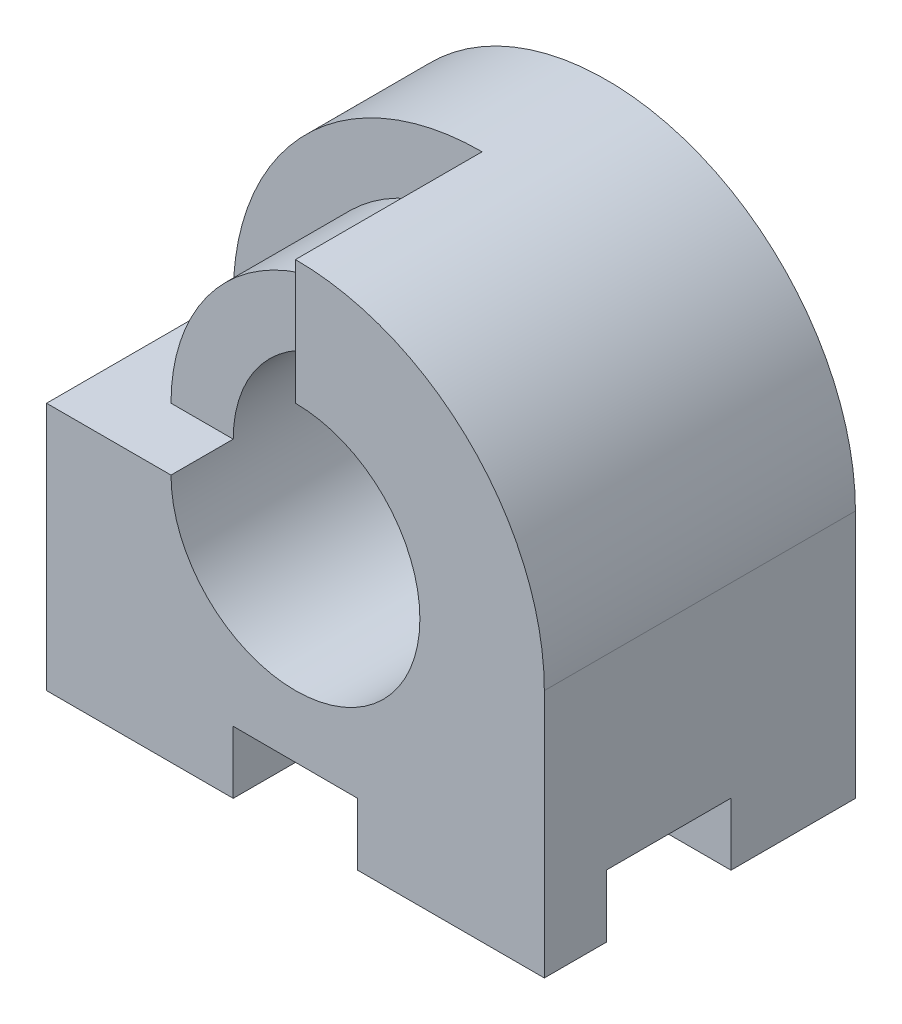
ISO-10303-21;
HEADER;
FILE_DESCRIPTION(('STEP AP214'),'2;1');
FILE_NAME('part.step','',(''),(''),'','','');
FILE_SCHEMA(('AUTOMOTIVE_DESIGN { 1 0 10303 214 1 1 1 1 }'));
ENDSEC;
DATA;
#1=APPLICATION_CONTEXT('core data for automotive mechanical design processes');
#2=APPLICATION_PROTOCOL_DEFINITION('international standard','automotive_design',2000,#1);
#3=PRODUCT_CONTEXT('',#1,'mechanical');
#4=PRODUCT('Part','Part','',(#3));
#5=PRODUCT_RELATED_PRODUCT_CATEGORY('part','',(#4));
#6=PRODUCT_DEFINITION_FORMATION('','',#4);
#7=PRODUCT_DEFINITION_CONTEXT('part definition',#1,'design');
#8=PRODUCT_DEFINITION('design','',#6,#7);
#9=PRODUCT_DEFINITION_SHAPE('','',#8);
#10=(LENGTH_UNIT() NAMED_UNIT(*) SI_UNIT(.MILLI.,.METRE.));
#11=(NAMED_UNIT(*) PLANE_ANGLE_UNIT() SI_UNIT($,.RADIAN.));
#12=(NAMED_UNIT(*) SI_UNIT($,.STERADIAN.) SOLID_ANGLE_UNIT());
#13=UNCERTAINTY_MEASURE_WITH_UNIT(LENGTH_MEASURE(1.E-05),#10,'distance_accuracy_value','');
#14=(GEOMETRIC_REPRESENTATION_CONTEXT(3) GLOBAL_UNCERTAINTY_ASSIGNED_CONTEXT((#13)) GLOBAL_UNIT_ASSIGNED_CONTEXT((#10,
#11,#12)) REPRESENTATION_CONTEXT('',''));
#15=CARTESIAN_POINT('',(0.,0.,0.));
#16=DIRECTION('',(0.,0.,1.));
#17=DIRECTION('',(1.,0.,0.));
#18=AXIS2_PLACEMENT_3D('',#15,#16,#17);
#19=CARTESIAN_POINT('',(4.,4.,2.));
#20=DIRECTION('',(0.,0.,-1.));
#21=DIRECTION('',(-1.,0.,0.));
#22=AXIS2_PLACEMENT_3D('',#19,#20,#21);
#23=PLANE('',#22);
#24=DIRECTION('',(1.,0.,0.));
#25=VECTOR('',#24,1.);
#26=CARTESIAN_POINT('',(0.,1.00354400233384,2.));
#27=LINE('',#26,#25);
#28=CARTESIAN_POINT('',(0.,1.00354400233384,2.));
#29=VERTEX_POINT('',#28);
#30=CARTESIAN_POINT('',(8.,1.00354400233384,2.));
#31=VERTEX_POINT('',#30);
#32=EDGE_CURVE('E240',#29,#31,#27,.T.);
#33=ORIENTED_EDGE('',*,*,#32,.F.);
#34=DIRECTION('',(0.,-1.,0.));
#35=VECTOR('',#34,1.);
#36=CARTESIAN_POINT('',(0.,4.,2.));
#37=LINE('',#36,#35);
#38=CARTESIAN_POINT('',(0.,0.,2.));
#39=VERTEX_POINT('',#38);
#40=EDGE_CURVE('E402',#29,#39,#37,.T.);
#41=ORIENTED_EDGE('',*,*,#40,.T.);
#42=DIRECTION('',(1.,0.,0.));
#43=VECTOR('',#42,1.);
#44=CARTESIAN_POINT('',(0.,0.,2.));
#45=LINE('',#44,#43);
#46=CARTESIAN_POINT('',(3.,0.,2.));
#47=VERTEX_POINT('',#46);
#48=EDGE_CURVE('E422',#39,#47,#45,.T.);
#49=ORIENTED_EDGE('',*,*,#48,.T.);
#50=DIRECTION('',(0.,1.,0.));
#51=VECTOR('',#50,1.);
#52=CARTESIAN_POINT('',(3.,0.,2.));
#53=LINE('',#52,#51);
#54=CARTESIAN_POINT('',(3.,1.,2.));
#55=VERTEX_POINT('',#54);
#56=EDGE_CURVE('E426',#47,#55,#53,.T.);
#57=ORIENTED_EDGE('',*,*,#56,.T.);
#58=DIRECTION('',(1.,0.,0.));
#59=VECTOR('',#58,1.);
#60=CARTESIAN_POINT('',(3.,1.,2.));
#61=LINE('',#60,#59);
#62=CARTESIAN_POINT('',(5.,1.,2.));
#63=VERTEX_POINT('',#62);
#64=EDGE_CURVE('E428',#55,#63,#61,.T.);
#65=ORIENTED_EDGE('',*,*,#64,.T.);
#66=DIRECTION('',(0.,-1.,0.));
#67=VECTOR('',#66,1.);
#68=CARTESIAN_POINT('',(5.,1.,2.));
#69=LINE('',#68,#67);
#70=CARTESIAN_POINT('',(5.,0.,2.));
#71=VERTEX_POINT('',#70);
#72=EDGE_CURVE('E430',#63,#71,#69,.T.);
#73=ORIENTED_EDGE('',*,*,#72,.T.);
#74=DIRECTION('',(1.,0.,0.));
#75=VECTOR('',#74,1.);
#76=CARTESIAN_POINT('',(5.,0.,2.));
#77=LINE('',#76,#75);
#78=CARTESIAN_POINT('',(8.,0.,2.));
#79=VERTEX_POINT('',#78);
#80=EDGE_CURVE('E375',#71,#79,#77,.T.);
#81=ORIENTED_EDGE('',*,*,#80,.T.);
#82=DIRECTION('',(0.,1.,0.));
#83=VECTOR('',#82,1.);
#84=CARTESIAN_POINT('',(8.,0.,2.));
#85=LINE('',#84,#83);
#86=EDGE_CURVE('E370',#79,#31,#85,.T.);
#87=ORIENTED_EDGE('',*,*,#86,.T.);
#88=EDGE_LOOP('',(#33,#41,#49,#57,#65,#73,#81,#87));
#89=FACE_BOUND('',#88,.T.);
#90=ADVANCED_FACE('F35',(#89),#23,.F.);
#91=CARTESIAN_POINT('',(4.,4.,2.));
#92=DIRECTION('',(0.,0.,1.));
#93=DIRECTION('',(1.,0.,0.));
#94=AXIS2_PLACEMENT_3D('',#91,#92,#93);
#95=CIRCLE('',#94,3.);
#96=CARTESIAN_POINT('',(1.,4.,2.));
#97=VERTEX_POINT('',#96);
#98=CARTESIAN_POINT('',(4.,7.,2.));
#99=VERTEX_POINT('',#98);
#100=EDGE_CURVE('E206',#97,#99,#95,.F.);
#101=ORIENTED_EDGE('',*,*,#100,.T.);
#102=DIRECTION('',(0.,1.,0.));
#103=VECTOR('',#102,1.);
#104=CARTESIAN_POINT('',(4.,0.,2.));
#105=LINE('',#104,#103);
#106=CARTESIAN_POINT('',(4.,8.,2.));
#107=VERTEX_POINT('',#106);
#108=EDGE_CURVE('E248',#99,#107,#105,.T.);
#109=ORIENTED_EDGE('',*,*,#108,.T.);
#110=CARTESIAN_POINT('',(4.,4.,2.));
#111=DIRECTION('',(0.,0.,1.));
#112=DIRECTION('',(-1.,0.,0.));
#113=AXIS2_PLACEMENT_3D('',#110,#111,#112);
#114=CIRCLE('',#113,4.);
#115=CARTESIAN_POINT('',(0.,4.,2.));
#116=VERTEX_POINT('',#115);
#117=EDGE_CURVE('E368',#107,#116,#114,.T.);
#118=ORIENTED_EDGE('',*,*,#117,.T.);
#119=DIRECTION('',(-1.,0.,0.));
#120=VECTOR('',#119,1.);
#121=CARTESIAN_POINT('',(-1.07552855510561E-13,3.99999999999997,2.));
#122=LINE('',#121,#120);
#123=EDGE_CURVE('E209',#97,#116,#122,.T.);
#124=ORIENTED_EDGE('',*,*,#123,.F.);
#125=EDGE_LOOP('',(#101,#109,#118,#124));
#126=FACE_BOUND('',#125,.T.);
#127=ADVANCED_FACE('F365',(#126),#23,.F.);
#128=CARTESIAN_POINT('',(4.,4.,0.));
#129=DIRECTION('',(0.,0.,-1.));
#130=DIRECTION('',(-1.,0.,0.));
#131=AXIS2_PLACEMENT_3D('',#128,#129,#130);
#132=PLANE('',#131);
#133=DIRECTION('',(0.,-1.,0.));
#134=VECTOR('',#133,1.);
#135=CARTESIAN_POINT('',(0.,4.,0.));
#136=LINE('',#135,#134);
#137=CARTESIAN_POINT('',(0.,4.,0.));
#138=VERTEX_POINT('',#137);
#139=CARTESIAN_POINT('',(0.,0.,0.));
#140=VERTEX_POINT('',#139);
#141=EDGE_CURVE('E386',#138,#140,#136,.T.);
#142=ORIENTED_EDGE('',*,*,#141,.F.);
#143=CARTESIAN_POINT('',(4.,4.,0.));
#144=DIRECTION('',(0.,0.,1.));
#145=DIRECTION('',(-1.,0.,0.));
#146=AXIS2_PLACEMENT_3D('',#143,#144,#145);
#147=CIRCLE('',#146,4.);
#148=CARTESIAN_POINT('',(8.,4.,0.));
#149=VERTEX_POINT('',#148);
#150=EDGE_CURVE('E401',#149,#138,#147,.T.);
#151=ORIENTED_EDGE('',*,*,#150,.F.);
#152=DIRECTION('',(0.,1.,0.));
#153=VECTOR('',#152,1.);
#154=CARTESIAN_POINT('',(8.,0.,0.));
#155=LINE('',#154,#153);
#156=CARTESIAN_POINT('',(8.,0.,0.));
#157=VERTEX_POINT('',#156);
#158=EDGE_CURVE('E399',#157,#149,#155,.T.);
#159=ORIENTED_EDGE('',*,*,#158,.F.);
#160=DIRECTION('',(1.,0.,0.));
#161=VECTOR('',#160,1.);
#162=CARTESIAN_POINT('',(5.,0.,0.));
#163=LINE('',#162,#161);
#164=CARTESIAN_POINT('',(5.,0.,0.));
#165=VERTEX_POINT('',#164);
#166=EDGE_CURVE('E397',#165,#157,#163,.T.);
#167=ORIENTED_EDGE('',*,*,#166,.F.);
#168=DIRECTION('',(0.,-1.,0.));
#169=VECTOR('',#168,1.);
#170=CARTESIAN_POINT('',(5.,1.,0.));
#171=LINE('',#170,#169);
#172=CARTESIAN_POINT('',(5.,1.,0.));
#173=VERTEX_POINT('',#172);
#174=EDGE_CURVE('E395',#173,#165,#171,.T.);
#175=ORIENTED_EDGE('',*,*,#174,.F.);
#176=DIRECTION('',(1.,0.,0.));
#177=VECTOR('',#176,1.);
#178=CARTESIAN_POINT('',(3.,1.,0.));
#179=LINE('',#178,#177);
#180=CARTESIAN_POINT('',(3.,1.,0.));
#181=VERTEX_POINT('',#180);
#182=EDGE_CURVE('E393',#181,#173,#179,.T.);
#183=ORIENTED_EDGE('',*,*,#182,.F.);
#184=DIRECTION('',(0.,1.,0.));
#185=VECTOR('',#184,1.);
#186=CARTESIAN_POINT('',(3.,0.,0.));
#187=LINE('',#186,#185);
#188=CARTESIAN_POINT('',(3.,0.,0.));
#189=VERTEX_POINT('',#188);
#190=EDGE_CURVE('E391',#189,#181,#187,.T.);
#191=ORIENTED_EDGE('',*,*,#190,.F.);
#192=DIRECTION('',(1.,0.,0.));
#193=VECTOR('',#192,1.);
#194=CARTESIAN_POINT('',(0.,0.,0.));
#195=LINE('',#194,#193);
#196=EDGE_CURVE('E389',#140,#189,#195,.T.);
#197=ORIENTED_EDGE('',*,*,#196,.F.);
#198=EDGE_LOOP('',(#142,#151,#159,#167,#175,#183,#191,#197));
#199=FACE_BOUND('',#198,.T.);
#200=CARTESIAN_POINT('',(4.,4.,0.));
#201=DIRECTION('',(0.,0.,1.));
#202=DIRECTION('',(1.,0.,0.));
#203=AXIS2_PLACEMENT_3D('',#200,#201,#202);
#204=CIRCLE('',#203,2.);
#205=CARTESIAN_POINT('',(6.,4.,0.));
#206=VERTEX_POINT('',#205);
#207=EDGE_CURVE('E362',#206,#206,#204,.T.);
#208=ORIENTED_EDGE('',*,*,#207,.T.);
#209=EDGE_LOOP('',(#208));
#210=FACE_BOUND('',#209,.T.);
#211=ADVANCED_FACE('F444',(#199,#210),#132,.T.);
#212=CARTESIAN_POINT('',(0.,4.,2.));
#213=DIRECTION('',(1.,0.,0.));
#214=DIRECTION('',(0.,0.,-1.));
#215=AXIS2_PLACEMENT_3D('',#212,#213,#214);
#216=PLANE('',#215);
#217=ORIENTED_EDGE('',*,*,#141,.T.);
#218=DIRECTION('',(0.,0.,-1.));
#219=VECTOR('',#218,1.);
#220=CARTESIAN_POINT('',(0.,0.,2.));
#221=LINE('',#220,#219);
#222=EDGE_CURVE('E45',#39,#140,#221,.T.);
#223=ORIENTED_EDGE('',*,*,#222,.F.);
#224=ORIENTED_EDGE('',*,*,#40,.F.);
#225=DIRECTION('',(0.,0.,-1.));
#226=VECTOR('',#225,1.);
#227=CARTESIAN_POINT('',(0.,1.00354400233384,4.));
#228=LINE('',#227,#226);
#229=CARTESIAN_POINT('',(0.,1.00354400233384,4.));
#230=VERTEX_POINT('',#229);
#231=EDGE_CURVE('E254',#230,#29,#228,.T.);
#232=ORIENTED_EDGE('',*,*,#231,.F.);
#233=DIRECTION('',(0.,-1.,0.));
#234=VECTOR('',#233,1.);
#235=CARTESIAN_POINT('',(0.,0.,4.));
#236=LINE('',#235,#234);
#237=CARTESIAN_POINT('',(0.,0.,4.));
#238=VERTEX_POINT('',#237);
#239=EDGE_CURVE('E287',#230,#238,#236,.T.);
#240=ORIENTED_EDGE('',*,*,#239,.T.);
#241=DIRECTION('',(0.,0.,-1.));
#242=VECTOR('',#241,1.);
#243=CARTESIAN_POINT('',(0.,0.,5.));
#244=LINE('',#243,#242);
#245=CARTESIAN_POINT('',(0.,0.,5.));
#246=VERTEX_POINT('',#245);
#247=EDGE_CURVE('E207',#246,#238,#244,.T.);
#248=ORIENTED_EDGE('',*,*,#247,.F.);
#249=DIRECTION('',(0.,-1.,0.));
#250=VECTOR('',#249,1.);
#251=CARTESIAN_POINT('',(0.,0.,5.));
#252=LINE('',#251,#250);
#253=CARTESIAN_POINT('',(0.,4.,5.));
#254=VERTEX_POINT('',#253);
#255=EDGE_CURVE('E192',#254,#246,#252,.T.);
#256=ORIENTED_EDGE('',*,*,#255,.F.);
#257=DIRECTION('',(0.,0.,-1.));
#258=VECTOR('',#257,1.);
#259=CARTESIAN_POINT('',(0.,4.,4.));
#260=LINE('',#259,#258);
#261=EDGE_CURVE('E189',#254,#116,#260,.T.);
#262=ORIENTED_EDGE('',*,*,#261,.T.);
#263=DIRECTION('',(0.,0.,-1.));
#264=VECTOR('',#263,1.);
#265=CARTESIAN_POINT('',(0.,4.,2.));
#266=LINE('',#265,#264);
#267=EDGE_CURVE('E369',#116,#138,#266,.T.);
#268=ORIENTED_EDGE('',*,*,#267,.T.);
#269=EDGE_LOOP('',(#217,#223,#224,#232,#240,#248,#256,#262,#268));
#270=FACE_BOUND('',#269,.T.);
#271=ADVANCED_FACE('F37',(#270),#216,.F.);
#272=CARTESIAN_POINT('',(0.,0.,2.));
#273=DIRECTION('',(0.,1.,0.));
#274=DIRECTION('',(0.,0.,1.));
#275=AXIS2_PLACEMENT_3D('',#272,#273,#274);
#276=PLANE('',#275);
#277=ORIENTED_EDGE('',*,*,#196,.T.);
#278=DIRECTION('',(0.,0.,-1.));
#279=VECTOR('',#278,1.);
#280=CARTESIAN_POINT('',(3.,0.,2.));
#281=LINE('',#280,#279);
#282=EDGE_CURVE('E417',#47,#189,#281,.T.);
#283=ORIENTED_EDGE('',*,*,#282,.F.);
#284=ORIENTED_EDGE('',*,*,#48,.F.);
#285=ORIENTED_EDGE('',*,*,#222,.T.);
#286=EDGE_LOOP('',(#277,#283,#284,#285));
#287=FACE_BOUND('',#286,.T.);
#288=ADVANCED_FACE('F490',(#287),#276,.F.);
#289=CARTESIAN_POINT('',(3.,0.,2.));
#290=DIRECTION('',(-1.,0.,0.));
#291=DIRECTION('',(0.,0.,1.));
#292=AXIS2_PLACEMENT_3D('',#289,#290,#291);
#293=PLANE('',#292);
#294=ORIENTED_EDGE('',*,*,#190,.T.);
#295=DIRECTION('',(0.,0.,-1.));
#296=VECTOR('',#295,1.);
#297=CARTESIAN_POINT('',(3.,1.,2.));
#298=LINE('',#297,#296);
#299=EDGE_CURVE('E414',#55,#181,#298,.T.);
#300=ORIENTED_EDGE('',*,*,#299,.F.);
#301=ORIENTED_EDGE('',*,*,#56,.F.);
#302=ORIENTED_EDGE('',*,*,#282,.T.);
#303=EDGE_LOOP('',(#294,#300,#301,#302));
#304=FACE_BOUND('',#303,.T.);
#305=ADVANCED_FACE('F487',(#304),#293,.F.);
#306=CARTESIAN_POINT('',(3.,1.,2.));
#307=DIRECTION('',(0.,1.,0.));
#308=DIRECTION('',(0.,0.,1.));
#309=AXIS2_PLACEMENT_3D('',#306,#307,#308);
#310=PLANE('',#309);
#311=ORIENTED_EDGE('',*,*,#182,.T.);
#312=DIRECTION('',(0.,0.,-1.));
#313=VECTOR('',#312,1.);
#314=CARTESIAN_POINT('',(5.,1.,2.));
#315=LINE('',#314,#313);
#316=EDGE_CURVE('E411',#63,#173,#315,.T.);
#317=ORIENTED_EDGE('',*,*,#316,.F.);
#318=ORIENTED_EDGE('',*,*,#64,.F.);
#319=ORIENTED_EDGE('',*,*,#299,.T.);
#320=EDGE_LOOP('',(#311,#317,#318,#319));
#321=FACE_BOUND('',#320,.T.);
#322=ADVANCED_FACE('F483',(#321),#310,.F.);
#323=CARTESIAN_POINT('',(5.,1.,2.));
#324=DIRECTION('',(1.,0.,0.));
#325=DIRECTION('',(0.,0.,-1.));
#326=AXIS2_PLACEMENT_3D('',#323,#324,#325);
#327=PLANE('',#326);
#328=ORIENTED_EDGE('',*,*,#174,.T.);
#329=DIRECTION('',(0.,0.,-1.));
#330=VECTOR('',#329,1.);
#331=CARTESIAN_POINT('',(5.,0.,2.));
#332=LINE('',#331,#330);
#333=EDGE_CURVE('E408',#71,#165,#332,.T.);
#334=ORIENTED_EDGE('',*,*,#333,.F.);
#335=ORIENTED_EDGE('',*,*,#72,.F.);
#336=ORIENTED_EDGE('',*,*,#316,.T.);
#337=EDGE_LOOP('',(#328,#334,#335,#336));
#338=FACE_BOUND('',#337,.T.);
#339=ADVANCED_FACE('F480',(#338),#327,.F.);
#340=CARTESIAN_POINT('',(5.,0.,2.));
#341=DIRECTION('',(0.,1.,0.));
#342=DIRECTION('',(0.,0.,1.));
#343=AXIS2_PLACEMENT_3D('',#340,#341,#342);
#344=PLANE('',#343);
#345=ORIENTED_EDGE('',*,*,#166,.T.);
#346=DIRECTION('',(0.,0.,-1.));
#347=VECTOR('',#346,1.);
#348=CARTESIAN_POINT('',(8.,0.,2.));
#349=LINE('',#348,#347);
#350=EDGE_CURVE('E405',#79,#157,#349,.T.);
#351=ORIENTED_EDGE('',*,*,#350,.F.);
#352=ORIENTED_EDGE('',*,*,#80,.F.);
#353=ORIENTED_EDGE('',*,*,#333,.T.);
#354=EDGE_LOOP('',(#345,#351,#352,#353));
#355=FACE_BOUND('',#354,.T.);
#356=ADVANCED_FACE('F438',(#355),#344,.F.);
#357=CARTESIAN_POINT('',(8.,0.,2.));
#358=DIRECTION('',(-1.,0.,0.));
#359=DIRECTION('',(0.,0.,1.));
#360=AXIS2_PLACEMENT_3D('',#357,#358,#359);
#361=PLANE('',#360);
#362=ORIENTED_EDGE('',*,*,#158,.T.);
#363=DIRECTION('',(0.,0.,-1.));
#364=VECTOR('',#363,1.);
#365=CARTESIAN_POINT('',(8.,4.,2.));
#366=LINE('',#365,#364);
#367=CARTESIAN_POINT('',(8.,4.,5.));
#368=VERTEX_POINT('',#367);
#369=EDGE_CURVE('E373',#368,#149,#366,.T.);
#370=ORIENTED_EDGE('',*,*,#369,.F.);
#371=DIRECTION('',(0.,1.,0.));
#372=VECTOR('',#371,1.);
#373=CARTESIAN_POINT('',(8.,0.,5.));
#374=LINE('',#373,#372);
#375=CARTESIAN_POINT('',(8.,0.,5.));
#376=VERTEX_POINT('',#375);
#377=EDGE_CURVE('E314',#376,#368,#374,.T.);
#378=ORIENTED_EDGE('',*,*,#377,.F.);
#379=DIRECTION('',(0.,0.,-1.));
#380=VECTOR('',#379,1.);
#381=CARTESIAN_POINT('',(8.,0.,5.));
#382=LINE('',#381,#380);
#383=CARTESIAN_POINT('',(8.,0.,4.));
#384=VERTEX_POINT('',#383);
#385=EDGE_CURVE('E222',#376,#384,#382,.T.);
#386=ORIENTED_EDGE('',*,*,#385,.T.);
#387=DIRECTION('',(0.,1.,0.));
#388=VECTOR('',#387,1.);
#389=CARTESIAN_POINT('',(8.,0.,4.));
#390=LINE('',#389,#388);
#391=CARTESIAN_POINT('',(8.,1.00354400233384,4.));
#392=VERTEX_POINT('',#391);
#393=EDGE_CURVE('E203',#384,#392,#390,.T.);
#394=ORIENTED_EDGE('',*,*,#393,.T.);
#395=DIRECTION('',(0.,0.,-1.));
#396=VECTOR('',#395,1.);
#397=CARTESIAN_POINT('',(8.,1.00354400233384,4.));
#398=LINE('',#397,#396);
#399=EDGE_CURVE('E251',#392,#31,#398,.T.);
#400=ORIENTED_EDGE('',*,*,#399,.T.);
#401=ORIENTED_EDGE('',*,*,#86,.F.);
#402=ORIENTED_EDGE('',*,*,#350,.T.);
#403=EDGE_LOOP('',(#362,#370,#378,#386,#394,#400,#401,#402));
#404=FACE_BOUND('',#403,.T.);
#405=ADVANCED_FACE('F312',(#404),#361,.F.);
#406=CARTESIAN_POINT('',(4.,4.,2.));
#407=DIRECTION('',(0.,0.,-1.));
#408=DIRECTION('',(-1.,0.,0.));
#409=AXIS2_PLACEMENT_3D('',#406,#407,#408);
#410=CYLINDRICAL_SURFACE('',#409,4.);
#411=ORIENTED_EDGE('',*,*,#150,.T.);
#412=ORIENTED_EDGE('',*,*,#267,.F.);
#413=ORIENTED_EDGE('',*,*,#117,.F.);
#414=DIRECTION('',(0.,0.,-1.));
#415=VECTOR('',#414,1.);
#416=CARTESIAN_POINT('',(4.,8.,4.));
#417=LINE('',#416,#415);
#418=CARTESIAN_POINT('',(4.,8.,5.));
#419=VERTEX_POINT('',#418);
#420=EDGE_CURVE('E228',#419,#107,#417,.T.);
#421=ORIENTED_EDGE('',*,*,#420,.F.);
#422=CARTESIAN_POINT('',(4.,4.,5.));
#423=DIRECTION('',(0.,0.,1.));
#424=DIRECTION('',(1.,0.,0.));
#425=AXIS2_PLACEMENT_3D('',#422,#423,#424);
#426=CIRCLE('',#425,4.);
#427=EDGE_CURVE('E348',#368,#419,#426,.T.);
#428=ORIENTED_EDGE('',*,*,#427,.F.);
#429=ORIENTED_EDGE('',*,*,#369,.T.);
#430=EDGE_LOOP('',(#411,#412,#413,#421,#428,#429));
#431=FACE_BOUND('',#430,.T.);
#432=ADVANCED_FACE('F447',(#431),#410,.T.);
#433=CARTESIAN_POINT('',(4.,4.,2.));
#434=DIRECTION('',(0.,0.,-1.));
#435=DIRECTION('',(-1.,0.,0.));
#436=AXIS2_PLACEMENT_3D('',#433,#434,#435);
#437=CYLINDRICAL_SURFACE('',#436,2.);
#438=ORIENTED_EDGE('',*,*,#207,.F.);
#439=EDGE_LOOP('',(#438));
#440=FACE_BOUND('',#439,.T.);
#441=CARTESIAN_POINT('',(4.,4.,4.));
#442=DIRECTION('',(0.,0.,1.));
#443=DIRECTION('',(1.,0.,0.));
#444=AXIS2_PLACEMENT_3D('',#441,#442,#443);
#445=CIRCLE('',#444,2.);
#446=CARTESIAN_POINT('',(2.,4.,4.));
#447=VERTEX_POINT('',#446);
#448=CARTESIAN_POINT('',(4.,6.,4.));
#449=VERTEX_POINT('',#448);
#450=EDGE_CURVE('E53',#447,#449,#445,.F.);
#451=ORIENTED_EDGE('',*,*,#450,.F.);
#452=DIRECTION('',(0.,0.,-1.));
#453=VECTOR('',#452,1.);
#454=CARTESIAN_POINT('',(2.,4.,5.));
#455=LINE('',#454,#453);
#456=CARTESIAN_POINT('',(2.,4.,5.));
#457=VERTEX_POINT('',#456);
#458=EDGE_CURVE('E187',#457,#447,#455,.T.);
#459=ORIENTED_EDGE('',*,*,#458,.F.);
#460=CARTESIAN_POINT('',(4.,4.,5.));
#461=DIRECTION('',(0.,0.,1.));
#462=DIRECTION('',(1.,0.,0.));
#463=AXIS2_PLACEMENT_3D('',#460,#461,#462);
#464=CIRCLE('',#463,2.);
#465=CARTESIAN_POINT('',(3.99999999999999,6.,5.));
#466=VERTEX_POINT('',#465);
#467=EDGE_CURVE('E193',#466,#457,#464,.F.);
#468=ORIENTED_EDGE('',*,*,#467,.F.);
#469=DIRECTION('',(0.,0.,-1.));
#470=VECTOR('',#469,1.);
#471=CARTESIAN_POINT('',(3.99999999999999,6.,5.));
#472=LINE('',#471,#470);
#473=EDGE_CURVE('E220',#466,#449,#472,.T.);
#474=ORIENTED_EDGE('',*,*,#473,.T.);
#475=EDGE_LOOP('',(#451,#459,#468,#474));
#476=FACE_BOUND('',#475,.T.);
#477=ADVANCED_FACE('F205',(#440,#476),#437,.F.);
#478=CARTESIAN_POINT('',(4.,4.,4.));
#479=DIRECTION('',(0.,0.,-1.));
#480=DIRECTION('',(-1.,0.,0.));
#481=AXIS2_PLACEMENT_3D('',#478,#479,#480);
#482=CYLINDRICAL_SURFACE('',#481,3.);
#483=ORIENTED_EDGE('',*,*,#100,.F.);
#484=DIRECTION('',(0.,0.,-1.));
#485=VECTOR('',#484,1.);
#486=CARTESIAN_POINT('',(1.,4.,4.));
#487=LINE('',#486,#485);
#488=CARTESIAN_POINT('',(1.,4.,4.));
#489=VERTEX_POINT('',#488);
#490=EDGE_CURVE('E265',#489,#97,#487,.T.);
#491=ORIENTED_EDGE('',*,*,#490,.F.);
#492=CARTESIAN_POINT('',(4.,4.,4.));
#493=DIRECTION('',(0.,0.,1.));
#494=DIRECTION('',(1.,0.,0.));
#495=AXIS2_PLACEMENT_3D('',#492,#493,#494);
#496=CIRCLE('',#495,3.);
#497=CARTESIAN_POINT('',(4.,7.,4.));
#498=VERTEX_POINT('',#497);
#499=EDGE_CURVE('E232',#489,#498,#496,.F.);
#500=ORIENTED_EDGE('',*,*,#499,.T.);
#501=DIRECTION('',(0.,0.,-1.));
#502=VECTOR('',#501,1.);
#503=CARTESIAN_POINT('',(4.,7.,4.));
#504=LINE('',#503,#502);
#505=EDGE_CURVE('E225',#498,#99,#504,.T.);
#506=ORIENTED_EDGE('',*,*,#505,.T.);
#507=EDGE_LOOP('',(#483,#491,#500,#506));
#508=FACE_BOUND('',#507,.T.);
#509=ADVANCED_FACE('F363',(#508),#482,.T.);
#510=CARTESIAN_POINT('',(-1.07552855510561E-13,3.99999999999997,4.));
#511=DIRECTION('',(0.,-1.,0.));
#512=DIRECTION('',(1.,0.,0.));
#513=AXIS2_PLACEMENT_3D('',#510,#511,#512);
#514=PLANE('',#513);
#515=ORIENTED_EDGE('',*,*,#123,.T.);
#516=ORIENTED_EDGE('',*,*,#261,.F.);
#517=DIRECTION('',(-1.,0.,0.));
#518=VECTOR('',#517,1.);
#519=CARTESIAN_POINT('',(0.,4.,5.));
#520=LINE('',#519,#518);
#521=EDGE_CURVE('E182',#457,#254,#520,.T.);
#522=ORIENTED_EDGE('',*,*,#521,.F.);
#523=ORIENTED_EDGE('',*,*,#458,.T.);
#524=DIRECTION('',(-1.,0.,0.));
#525=VECTOR('',#524,1.);
#526=CARTESIAN_POINT('',(0.,4.,4.));
#527=LINE('',#526,#525);
#528=EDGE_CURVE('E57',#447,#489,#527,.T.);
#529=ORIENTED_EDGE('',*,*,#528,.T.);
#530=ORIENTED_EDGE('',*,*,#490,.T.);
#531=EDGE_LOOP('',(#515,#516,#522,#523,#529,#530));
#532=FACE_BOUND('',#531,.T.);
#533=ADVANCED_FACE('F185',(#532),#514,.F.);
#534=CARTESIAN_POINT('',(0.,1.00354400233384,4.));
#535=DIRECTION('',(0.,1.,0.));
#536=DIRECTION('',(0.,0.,1.));
#537=AXIS2_PLACEMENT_3D('',#534,#535,#536);
#538=PLANE('',#537);
#539=ORIENTED_EDGE('',*,*,#32,.T.);
#540=ORIENTED_EDGE('',*,*,#399,.F.);
#541=DIRECTION('',(1.,0.,0.));
#542=VECTOR('',#541,1.);
#543=CARTESIAN_POINT('',(0.,1.00354400233384,4.));
#544=LINE('',#543,#542);
#545=CARTESIAN_POINT('',(3.,1.00354400233384,4.));
#546=VERTEX_POINT('',#545);
#547=EDGE_CURVE('E230',#546,#392,#544,.T.);
#548=ORIENTED_EDGE('',*,*,#547,.F.);
#549=EDGE_CURVE('E39',#230,#546,#544,.T.);
#550=ORIENTED_EDGE('',*,*,#549,.F.);
#551=ORIENTED_EDGE('',*,*,#231,.T.);
#552=EDGE_LOOP('',(#539,#540,#548,#550,#551));
#553=FACE_BOUND('',#552,.T.);
#554=ADVANCED_FACE('F320',(#553),#538,.F.);
#555=CARTESIAN_POINT('',(4.,0.,4.));
#556=DIRECTION('',(-1.,0.,0.));
#557=DIRECTION('',(0.,0.,1.));
#558=AXIS2_PLACEMENT_3D('',#555,#556,#557);
#559=PLANE('',#558);
#560=ORIENTED_EDGE('',*,*,#108,.F.);
#561=ORIENTED_EDGE('',*,*,#505,.F.);
#562=DIRECTION('',(0.,-1.,0.));
#563=VECTOR('',#562,1.);
#564=CARTESIAN_POINT('',(4.,0.,4.));
#565=LINE('',#564,#563);
#566=EDGE_CURVE('E11',#498,#449,#565,.T.);
#567=ORIENTED_EDGE('',*,*,#566,.T.);
#568=ORIENTED_EDGE('',*,*,#473,.F.);
#569=DIRECTION('',(0.,-1.,0.));
#570=VECTOR('',#569,1.);
#571=CARTESIAN_POINT('',(4.,0.,5.));
#572=LINE('',#571,#570);
#573=EDGE_CURVE('E199',#419,#466,#572,.T.);
#574=ORIENTED_EDGE('',*,*,#573,.F.);
#575=ORIENTED_EDGE('',*,*,#420,.T.);
#576=EDGE_LOOP('',(#560,#561,#567,#568,#574,#575));
#577=FACE_BOUND('',#576,.T.);
#578=ADVANCED_FACE('F355',(#577),#559,.T.);
#579=CARTESIAN_POINT('',(0.,0.,4.));
#580=DIRECTION('',(0.,0.,1.));
#581=DIRECTION('',(1.,0.,0.));
#582=AXIS2_PLACEMENT_3D('',#579,#580,#581);
#583=PLANE('',#582);
#584=ORIENTED_EDGE('',*,*,#566,.F.);
#585=ORIENTED_EDGE('',*,*,#499,.F.);
#586=ORIENTED_EDGE('',*,*,#528,.F.);
#587=ORIENTED_EDGE('',*,*,#450,.T.);
#588=EDGE_LOOP('',(#584,#585,#586,#587));
#589=FACE_BOUND('',#588,.T.);
#590=ADVANCED_FACE('F358',(#589),#583,.T.);
#591=CARTESIAN_POINT('',(0.,0.,4.));
#592=DIRECTION('',(0.,0.,1.));
#593=DIRECTION('',(1.,0.,0.));
#594=AXIS2_PLACEMENT_3D('',#591,#592,#593);
#595=PLANE('',#594);
#596=ORIENTED_EDGE('',*,*,#239,.F.);
#597=ORIENTED_EDGE('',*,*,#549,.T.);
#598=DIRECTION('',(0.,1.,0.));
#599=VECTOR('',#598,1.);
#600=CARTESIAN_POINT('',(3.,0.,4.));
#601=LINE('',#600,#599);
#602=CARTESIAN_POINT('',(3.,0.,4.));
#603=VERTEX_POINT('',#602);
#604=EDGE_CURVE('E295',#603,#546,#601,.T.);
#605=ORIENTED_EDGE('',*,*,#604,.F.);
#606=DIRECTION('',(1.,0.,0.));
#607=VECTOR('',#606,1.);
#608=CARTESIAN_POINT('',(0.,0.,4.));
#609=LINE('',#608,#607);
#610=EDGE_CURVE('E289',#238,#603,#609,.T.);
#611=ORIENTED_EDGE('',*,*,#610,.F.);
#612=EDGE_LOOP('',(#596,#597,#605,#611));
#613=FACE_BOUND('',#612,.T.);
#614=ADVANCED_FACE('F324',(#613),#595,.F.);
#615=DIRECTION('',(0.99999843000963,-0.0017719983848935,0.));
#616=VECTOR('',#615,1.);
#617=CARTESIAN_POINT('',(0.00178769549425343,1.00885683803609,4.));
#618=LINE('',#617,#616);
#619=CARTESIAN_POINT('',(5.,1.,4.));
#620=VERTEX_POINT('',#619);
#621=EDGE_CURVE('E298',#546,#620,#618,.T.);
#622=ORIENTED_EDGE('',*,*,#621,.F.);
#623=ORIENTED_EDGE('',*,*,#547,.T.);
#624=ORIENTED_EDGE('',*,*,#393,.F.);
#625=DIRECTION('',(1.,0.,0.));
#626=VECTOR('',#625,1.);
#627=CARTESIAN_POINT('',(0.,0.,4.));
#628=LINE('',#627,#626);
#629=CARTESIAN_POINT('',(5.,0.,4.));
#630=VERTEX_POINT('',#629);
#631=EDGE_CURVE('E286',#630,#384,#628,.T.);
#632=ORIENTED_EDGE('',*,*,#631,.F.);
#633=DIRECTION('',(0.,-1.,0.));
#634=VECTOR('',#633,1.);
#635=CARTESIAN_POINT('',(5.,0.,4.));
#636=LINE('',#635,#634);
#637=EDGE_CURVE('E300',#620,#630,#636,.T.);
#638=ORIENTED_EDGE('',*,*,#637,.F.);
#639=EDGE_LOOP('',(#622,#623,#624,#632,#638));
#640=FACE_BOUND('',#639,.T.);
#641=ADVANCED_FACE('F316',(#640),#595,.F.);
#642=CARTESIAN_POINT('',(0.,0.,5.));
#643=DIRECTION('',(0.,1.,0.));
#644=DIRECTION('',(0.,0.,1.));
#645=AXIS2_PLACEMENT_3D('',#642,#643,#644);
#646=PLANE('',#645);
#647=ORIENTED_EDGE('',*,*,#610,.T.);
#648=DIRECTION('',(0.,0.,-1.));
#649=VECTOR('',#648,1.);
#650=CARTESIAN_POINT('',(3.,0.,5.));
#651=LINE('',#650,#649);
#652=CARTESIAN_POINT('',(3.,0.,5.));
#653=VERTEX_POINT('',#652);
#654=EDGE_CURVE('E212',#653,#603,#651,.T.);
#655=ORIENTED_EDGE('',*,*,#654,.F.);
#656=DIRECTION('',(1.,0.,0.));
#657=VECTOR('',#656,1.);
#658=CARTESIAN_POINT('',(0.,0.,5.));
#659=LINE('',#658,#657);
#660=EDGE_CURVE('E342',#246,#653,#659,.T.);
#661=ORIENTED_EDGE('',*,*,#660,.F.);
#662=ORIENTED_EDGE('',*,*,#247,.T.);
#663=EDGE_LOOP('',(#647,#655,#661,#662));
#664=FACE_BOUND('',#663,.T.);
#665=ADVANCED_FACE('F454',(#664),#646,.F.);
#666=CARTESIAN_POINT('',(3.,0.,5.));
#667=DIRECTION('',(-1.,0.,0.));
#668=DIRECTION('',(0.,0.,1.));
#669=AXIS2_PLACEMENT_3D('',#666,#667,#668);
#670=PLANE('',#669);
#671=ORIENTED_EDGE('',*,*,#604,.T.);
#672=DIRECTION('',(0.,0.,-1.));
#673=VECTOR('',#672,1.);
#674=CARTESIAN_POINT('',(3.,1.00354400233384,5.));
#675=LINE('',#674,#673);
#676=CARTESIAN_POINT('',(3.,1.00354400233384,5.));
#677=VERTEX_POINT('',#676);
#678=EDGE_CURVE('E280',#677,#546,#675,.T.);
#679=ORIENTED_EDGE('',*,*,#678,.F.);
#680=DIRECTION('',(0.,1.,0.));
#681=VECTOR('',#680,1.);
#682=CARTESIAN_POINT('',(3.,0.,5.));
#683=LINE('',#682,#681);
#684=EDGE_CURVE('E338',#653,#677,#683,.T.);
#685=ORIENTED_EDGE('',*,*,#684,.F.);
#686=ORIENTED_EDGE('',*,*,#654,.T.);
#687=EDGE_LOOP('',(#671,#679,#685,#686));
#688=FACE_BOUND('',#687,.T.);
#689=ADVANCED_FACE('F328',(#688),#670,.F.);
#690=CARTESIAN_POINT('',(0.00178769549425343,1.00885683803609,5.));
#691=DIRECTION('',(0.0017719983848935,0.999998430009629,0.));
#692=DIRECTION('',(-0.99999843000963,0.0017719983848935,0.));
#693=AXIS2_PLACEMENT_3D('',#690,#691,#692);
#694=PLANE('',#693);
#695=ORIENTED_EDGE('',*,*,#621,.T.);
#696=DIRECTION('',(0.,0.,-1.));
#697=VECTOR('',#696,1.);
#698=CARTESIAN_POINT('',(5.,1.,5.));
#699=LINE('',#698,#697);
#700=CARTESIAN_POINT('',(5.,1.,5.));
#701=VERTEX_POINT('',#700);
#702=EDGE_CURVE('E277',#701,#620,#699,.T.);
#703=ORIENTED_EDGE('',*,*,#702,.F.);
#704=DIRECTION('',(0.99999843000963,-0.0017719983848935,0.));
#705=VECTOR('',#704,1.);
#706=CARTESIAN_POINT('',(0.00178769549425343,1.00885683803609,5.));
#707=LINE('',#706,#705);
#708=EDGE_CURVE('E335',#677,#701,#707,.T.);
#709=ORIENTED_EDGE('',*,*,#708,.F.);
#710=ORIENTED_EDGE('',*,*,#678,.T.);
#711=EDGE_LOOP('',(#695,#703,#709,#710));
#712=FACE_BOUND('',#711,.T.);
#713=ADVANCED_FACE('F333',(#712),#694,.F.);
#714=CARTESIAN_POINT('',(5.,0.,5.));
#715=DIRECTION('',(1.,0.,0.));
#716=DIRECTION('',(0.,0.,-1.));
#717=AXIS2_PLACEMENT_3D('',#714,#715,#716);
#718=PLANE('',#717);
#719=ORIENTED_EDGE('',*,*,#637,.T.);
#720=DIRECTION('',(0.,0.,-1.));
#721=VECTOR('',#720,1.);
#722=CARTESIAN_POINT('',(5.,0.,5.));
#723=LINE('',#722,#721);
#724=CARTESIAN_POINT('',(5.,0.,5.));
#725=VERTEX_POINT('',#724);
#726=EDGE_CURVE('E274',#725,#630,#723,.T.);
#727=ORIENTED_EDGE('',*,*,#726,.F.);
#728=DIRECTION('',(0.,-1.,0.));
#729=VECTOR('',#728,1.);
#730=CARTESIAN_POINT('',(5.,0.,5.));
#731=LINE('',#730,#729);
#732=EDGE_CURVE('E337',#701,#725,#731,.T.);
#733=ORIENTED_EDGE('',*,*,#732,.F.);
#734=ORIENTED_EDGE('',*,*,#702,.T.);
#735=EDGE_LOOP('',(#719,#727,#733,#734));
#736=FACE_BOUND('',#735,.T.);
#737=ADVANCED_FACE('F684',(#736),#718,.F.);
#738=CARTESIAN_POINT('',(0.,0.,5.));
#739=DIRECTION('',(0.,1.,0.));
#740=DIRECTION('',(0.,0.,1.));
#741=AXIS2_PLACEMENT_3D('',#738,#739,#740);
#742=PLANE('',#741);
#743=ORIENTED_EDGE('',*,*,#631,.T.);
#744=ORIENTED_EDGE('',*,*,#385,.F.);
#745=DIRECTION('',(1.,0.,0.));
#746=VECTOR('',#745,1.);
#747=CARTESIAN_POINT('',(0.,0.,5.));
#748=LINE('',#747,#746);
#749=EDGE_CURVE('E340',#725,#376,#748,.T.);
#750=ORIENTED_EDGE('',*,*,#749,.F.);
#751=ORIENTED_EDGE('',*,*,#726,.T.);
#752=EDGE_LOOP('',(#743,#744,#750,#751));
#753=FACE_BOUND('',#752,.T.);
#754=ADVANCED_FACE('F304',(#753),#742,.F.);
#755=CARTESIAN_POINT('',(0.,0.,5.));
#756=DIRECTION('',(0.,0.,1.));
#757=DIRECTION('',(1.,0.,0.));
#758=AXIS2_PLACEMENT_3D('',#755,#756,#757);
#759=PLANE('',#758);
#760=ORIENTED_EDGE('',*,*,#467,.T.);
#761=ORIENTED_EDGE('',*,*,#521,.T.);
#762=ORIENTED_EDGE('',*,*,#255,.T.);
#763=ORIENTED_EDGE('',*,*,#660,.T.);
#764=ORIENTED_EDGE('',*,*,#684,.T.);
#765=ORIENTED_EDGE('',*,*,#708,.T.);
#766=ORIENTED_EDGE('',*,*,#732,.T.);
#767=ORIENTED_EDGE('',*,*,#749,.T.);
#768=ORIENTED_EDGE('',*,*,#377,.T.);
#769=ORIENTED_EDGE('',*,*,#427,.T.);
#770=ORIENTED_EDGE('',*,*,#573,.T.);
#771=EDGE_LOOP('',(#760,#761,#762,#763,#764,#765,#766,#767,#768,#769,#770));
#772=FACE_BOUND('',#771,.T.);
#773=ADVANCED_FACE('F196',(#772),#759,.T.);
#774=CLOSED_SHELL('',(#90,#127,#211,#271,#288,#305,#322,#339,#356,#405,#432,#477,#509,#533,#554,
#578,#590,#614,#641,#665,#689,#713,#737,#754,#773));
#775=MANIFOLD_SOLID_BREP('B2',#774);
#776=ADVANCED_BREP_SHAPE_REPRESENTATION('',(#18,#775),#14);
#777=SHAPE_DEFINITION_REPRESENTATION(#9,#776);
ENDSEC;
END-ISO-10303-21;
